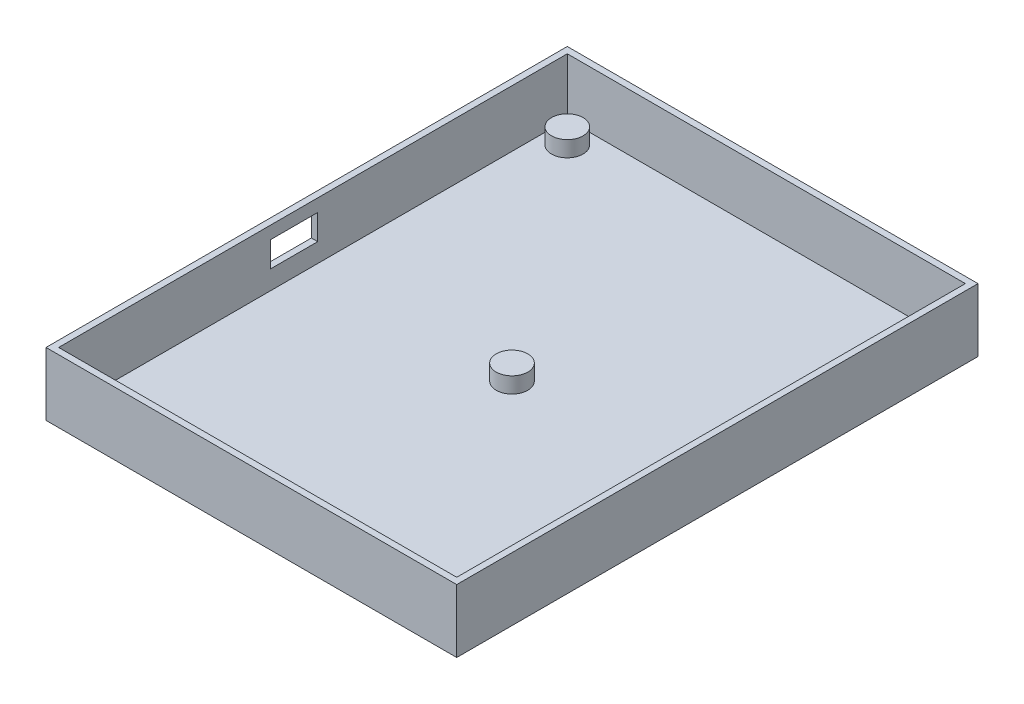
ISO-10303-21;
HEADER;
FILE_DESCRIPTION(('STEP AP214'),'2;1');
FILE_NAME('part.step','',(''),(''),'','','');
FILE_SCHEMA(('AUTOMOTIVE_DESIGN { 1 0 10303 214 1 1 1 1 }'));
ENDSEC;
DATA;
#1=APPLICATION_CONTEXT('core data for automotive mechanical design processes');
#2=APPLICATION_PROTOCOL_DEFINITION('international standard','automotive_design',2000,#1);
#3=PRODUCT_CONTEXT('',#1,'mechanical');
#4=PRODUCT('Part','Part','',(#3));
#5=PRODUCT_RELATED_PRODUCT_CATEGORY('part','',(#4));
#6=PRODUCT_DEFINITION_FORMATION('','',#4);
#7=PRODUCT_DEFINITION_CONTEXT('part definition',#1,'design');
#8=PRODUCT_DEFINITION('design','',#6,#7);
#9=PRODUCT_DEFINITION_SHAPE('','',#8);
#10=(LENGTH_UNIT() NAMED_UNIT(*) SI_UNIT(.MILLI.,.METRE.));
#11=(NAMED_UNIT(*) PLANE_ANGLE_UNIT() SI_UNIT($,.RADIAN.));
#12=(NAMED_UNIT(*) SI_UNIT($,.STERADIAN.) SOLID_ANGLE_UNIT());
#13=UNCERTAINTY_MEASURE_WITH_UNIT(LENGTH_MEASURE(1.E-05),#10,'distance_accuracy_value','');
#14=(GEOMETRIC_REPRESENTATION_CONTEXT(3) GLOBAL_UNCERTAINTY_ASSIGNED_CONTEXT((#13)) GLOBAL_UNIT_ASSIGNED_CONTEXT((#10,
#11,#12)) REPRESENTATION_CONTEXT('',''));
#15=CARTESIAN_POINT('',(0.,0.,0.));
#16=DIRECTION('',(0.,0.,1.));
#17=DIRECTION('',(1.,0.,0.));
#18=AXIS2_PLACEMENT_3D('',#15,#16,#17);
#19=CARTESIAN_POINT('',(32.5,10.,41.25));
#20=DIRECTION('',(-1.,0.,0.));
#21=DIRECTION('',(0.,0.,1.));
#22=AXIS2_PLACEMENT_3D('',#19,#20,#21);
#23=PLANE('',#22);
#24=DIRECTION('',(0.,0.,-1.));
#25=VECTOR('',#24,1.);
#26=CARTESIAN_POINT('',(32.5,0.,41.25));
#27=LINE('',#26,#25);
#28=CARTESIAN_POINT('',(32.5,0.,41.25));
#29=VERTEX_POINT('',#28);
#30=CARTESIAN_POINT('',(32.5,0.,-41.25));
#31=VERTEX_POINT('',#30);
#32=EDGE_CURVE('E212',#29,#31,#27,.T.);
#33=ORIENTED_EDGE('',*,*,#32,.T.);
#34=DIRECTION('',(0.,-1.,0.));
#35=VECTOR('',#34,1.);
#36=CARTESIAN_POINT('',(32.5,10.,-41.25));
#37=LINE('',#36,#35);
#38=CARTESIAN_POINT('',(32.5,10.,-41.25));
#39=VERTEX_POINT('',#38);
#40=EDGE_CURVE('E11',#39,#31,#37,.T.);
#41=ORIENTED_EDGE('',*,*,#40,.F.);
#42=DIRECTION('',(0.,0.,-1.));
#43=VECTOR('',#42,1.);
#44=CARTESIAN_POINT('',(32.5,10.,41.25));
#45=LINE('',#44,#43);
#46=CARTESIAN_POINT('',(32.5,10.,41.25));
#47=VERTEX_POINT('',#46);
#48=EDGE_CURVE('E219',#47,#39,#45,.T.);
#49=ORIENTED_EDGE('',*,*,#48,.F.);
#50=DIRECTION('',(0.,-1.,0.));
#51=VECTOR('',#50,1.);
#52=CARTESIAN_POINT('',(32.5,10.,41.25));
#53=LINE('',#52,#51);
#54=EDGE_CURVE('E229',#47,#29,#53,.T.);
#55=ORIENTED_EDGE('',*,*,#54,.T.);
#56=EDGE_LOOP('',(#33,#41,#49,#55));
#57=FACE_BOUND('',#56,.T.);
#58=ADVANCED_FACE('F32',(#57),#23,.F.);
#59=CARTESIAN_POINT('',(-32.5,10.,-41.25));
#60=DIRECTION('',(0.,0.,1.));
#61=DIRECTION('',(1.,0.,0.));
#62=AXIS2_PLACEMENT_3D('',#59,#60,#61);
#63=PLANE('',#62);
#64=DIRECTION('',(-1.,0.,0.));
#65=VECTOR('',#64,1.);
#66=CARTESIAN_POINT('',(-32.5,0.,-41.25));
#67=LINE('',#66,#65);
#68=CARTESIAN_POINT('',(-32.5,0.,-41.25));
#69=VERTEX_POINT('',#68);
#70=EDGE_CURVE('E232',#31,#69,#67,.T.);
#71=ORIENTED_EDGE('',*,*,#70,.T.);
#72=DIRECTION('',(0.,-1.,0.));
#73=VECTOR('',#72,1.);
#74=CARTESIAN_POINT('',(-32.5,10.,-41.25));
#75=LINE('',#74,#73);
#76=CARTESIAN_POINT('',(-32.5,10.,-41.25));
#77=VERTEX_POINT('',#76);
#78=EDGE_CURVE('E39',#77,#69,#75,.T.);
#79=ORIENTED_EDGE('',*,*,#78,.F.);
#80=DIRECTION('',(-1.,0.,0.));
#81=VECTOR('',#80,1.);
#82=CARTESIAN_POINT('',(-32.5,10.,-41.25));
#83=LINE('',#82,#81);
#84=EDGE_CURVE('E222',#39,#77,#83,.T.);
#85=ORIENTED_EDGE('',*,*,#84,.F.);
#86=ORIENTED_EDGE('',*,*,#40,.T.);
#87=EDGE_LOOP('',(#71,#79,#85,#86));
#88=FACE_BOUND('',#87,.T.);
#89=ADVANCED_FACE('F262',(#88),#63,.F.);
#90=CARTESIAN_POINT('',(-32.5,10.,41.25));
#91=DIRECTION('',(1.,0.,0.));
#92=DIRECTION('',(0.,0.,-1.));
#93=AXIS2_PLACEMENT_3D('',#90,#91,#92);
#94=PLANE('',#93);
#95=DIRECTION('',(0.,0.,1.));
#96=VECTOR('',#95,1.);
#97=CARTESIAN_POINT('',(-32.5,4.,-0.750000000000008));
#98=LINE('',#97,#96);
#99=CARTESIAN_POINT('',(-32.5,4.,-0.750000000000008));
#100=VERTEX_POINT('',#99);
#101=CARTESIAN_POINT('',(-32.5,4.,6.74999999999999));
#102=VERTEX_POINT('',#101);
#103=EDGE_CURVE('E147',#100,#102,#98,.T.);
#104=ORIENTED_EDGE('',*,*,#103,.F.);
#105=DIRECTION('',(0.,-1.,0.));
#106=VECTOR('',#105,1.);
#107=CARTESIAN_POINT('',(-32.5,8.,-0.750000000000008));
#108=LINE('',#107,#106);
#109=CARTESIAN_POINT('',(-32.5,8.,-0.750000000000008));
#110=VERTEX_POINT('',#109);
#111=EDGE_CURVE('E46',#110,#100,#108,.T.);
#112=ORIENTED_EDGE('',*,*,#111,.F.);
#113=DIRECTION('',(0.,0.,-1.));
#114=VECTOR('',#113,1.);
#115=CARTESIAN_POINT('',(-32.5,8.,-0.750000000000008));
#116=LINE('',#115,#114);
#117=CARTESIAN_POINT('',(-32.5,8.,6.74999999999999));
#118=VERTEX_POINT('',#117);
#119=EDGE_CURVE('E138',#118,#110,#116,.T.);
#120=ORIENTED_EDGE('',*,*,#119,.F.);
#121=DIRECTION('',(0.,1.,0.));
#122=VECTOR('',#121,1.);
#123=CARTESIAN_POINT('',(-32.5,8.,6.74999999999999));
#124=LINE('',#123,#122);
#125=EDGE_CURVE('E141',#102,#118,#124,.T.);
#126=ORIENTED_EDGE('',*,*,#125,.F.);
#127=EDGE_LOOP('',(#104,#112,#120,#126));
#128=FACE_BOUND('',#127,.T.);
#129=DIRECTION('',(0.,0.,1.));
#130=VECTOR('',#129,1.);
#131=CARTESIAN_POINT('',(-32.5,0.,41.25));
#132=LINE('',#131,#130);
#133=CARTESIAN_POINT('',(-32.5,0.,41.25));
#134=VERTEX_POINT('',#133);
#135=EDGE_CURVE('E234',#69,#134,#132,.T.);
#136=ORIENTED_EDGE('',*,*,#135,.T.);
#137=DIRECTION('',(0.,-1.,0.));
#138=VECTOR('',#137,1.);
#139=CARTESIAN_POINT('',(-32.5,10.,41.25));
#140=LINE('',#139,#138);
#141=CARTESIAN_POINT('',(-32.5,10.,41.25));
#142=VERTEX_POINT('',#141);
#143=EDGE_CURVE('E239',#142,#134,#140,.T.);
#144=ORIENTED_EDGE('',*,*,#143,.F.);
#145=DIRECTION('',(0.,0.,1.));
#146=VECTOR('',#145,1.);
#147=CARTESIAN_POINT('',(-32.5,10.,41.25));
#148=LINE('',#147,#146);
#149=EDGE_CURVE('E225',#77,#142,#148,.T.);
#150=ORIENTED_EDGE('',*,*,#149,.F.);
#151=ORIENTED_EDGE('',*,*,#78,.T.);
#152=EDGE_LOOP('',(#136,#144,#150,#151));
#153=FACE_BOUND('',#152,.T.);
#154=ADVANCED_FACE('F246',(#128,#153),#94,.F.);
#155=CARTESIAN_POINT('',(-32.5,10.,41.25));
#156=DIRECTION('',(0.,0.,-1.));
#157=DIRECTION('',(-1.,0.,0.));
#158=AXIS2_PLACEMENT_3D('',#155,#156,#157);
#159=PLANE('',#158);
#160=DIRECTION('',(1.,0.,0.));
#161=VECTOR('',#160,1.);
#162=CARTESIAN_POINT('',(-32.5,0.,41.25));
#163=LINE('',#162,#161);
#164=EDGE_CURVE('E223',#134,#29,#163,.T.);
#165=ORIENTED_EDGE('',*,*,#164,.T.);
#166=ORIENTED_EDGE('',*,*,#54,.F.);
#167=DIRECTION('',(1.,0.,0.));
#168=VECTOR('',#167,1.);
#169=CARTESIAN_POINT('',(-32.5,10.,41.25));
#170=LINE('',#169,#168);
#171=EDGE_CURVE('E227',#142,#47,#170,.T.);
#172=ORIENTED_EDGE('',*,*,#171,.F.);
#173=ORIENTED_EDGE('',*,*,#143,.T.);
#174=EDGE_LOOP('',(#165,#166,#172,#173));
#175=FACE_BOUND('',#174,.T.);
#176=ADVANCED_FACE('F255',(#175),#159,.F.);
#177=CARTESIAN_POINT('',(0.,10.,0.));
#178=DIRECTION('',(0.,-1.,0.));
#179=DIRECTION('',(0.,0.,-1.));
#180=AXIS2_PLACEMENT_3D('',#177,#178,#179);
#181=PLANE('',#180);
#182=DIRECTION('',(0.,0.,1.));
#183=VECTOR('',#182,1.);
#184=CARTESIAN_POINT('',(-31.5,10.,-40.25));
#185=LINE('',#184,#183);
#186=CARTESIAN_POINT('',(-31.5,10.,-40.25));
#187=VERTEX_POINT('',#186);
#188=CARTESIAN_POINT('',(-31.5,10.,40.25));
#189=VERTEX_POINT('',#188);
#190=EDGE_CURVE('E202',#187,#189,#185,.T.);
#191=ORIENTED_EDGE('',*,*,#190,.F.);
#192=DIRECTION('',(-1.,0.,0.));
#193=VECTOR('',#192,1.);
#194=CARTESIAN_POINT('',(31.5,10.,-40.25));
#195=LINE('',#194,#193);
#196=CARTESIAN_POINT('',(31.5,10.,-40.25));
#197=VERTEX_POINT('',#196);
#198=EDGE_CURVE('E184',#197,#187,#195,.T.);
#199=ORIENTED_EDGE('',*,*,#198,.F.);
#200=DIRECTION('',(0.,0.,-1.));
#201=VECTOR('',#200,1.);
#202=CARTESIAN_POINT('',(31.5,10.,40.25));
#203=LINE('',#202,#201);
#204=CARTESIAN_POINT('',(31.5,10.,40.25));
#205=VERTEX_POINT('',#204);
#206=EDGE_CURVE('E191',#205,#197,#203,.T.);
#207=ORIENTED_EDGE('',*,*,#206,.F.);
#208=DIRECTION('',(1.,0.,0.));
#209=VECTOR('',#208,1.);
#210=CARTESIAN_POINT('',(-31.5,10.,40.25));
#211=LINE('',#210,#209);
#212=EDGE_CURVE('E205',#189,#205,#211,.T.);
#213=ORIENTED_EDGE('',*,*,#212,.F.);
#214=EDGE_LOOP('',(#191,#199,#207,#213));
#215=FACE_BOUND('',#214,.T.);
#216=ORIENTED_EDGE('',*,*,#48,.T.);
#217=ORIENTED_EDGE('',*,*,#84,.T.);
#218=ORIENTED_EDGE('',*,*,#149,.T.);
#219=ORIENTED_EDGE('',*,*,#171,.T.);
#220=EDGE_LOOP('',(#216,#217,#218,#219));
#221=FACE_BOUND('',#220,.T.);
#222=ADVANCED_FACE('F261',(#215,#221),#181,.F.);
#223=CARTESIAN_POINT('',(0.,0.,0.));
#224=DIRECTION('',(0.,-1.,0.));
#225=DIRECTION('',(0.,0.,-1.));
#226=AXIS2_PLACEMENT_3D('',#223,#224,#225);
#227=PLANE('',#226);
#228=ORIENTED_EDGE('',*,*,#32,.F.);
#229=ORIENTED_EDGE('',*,*,#164,.F.);
#230=ORIENTED_EDGE('',*,*,#135,.F.);
#231=ORIENTED_EDGE('',*,*,#70,.F.);
#232=EDGE_LOOP('',(#228,#229,#230,#231));
#233=FACE_BOUND('',#232,.T.);
#234=ADVANCED_FACE('F252',(#233),#227,.T.);
#235=CARTESIAN_POINT('',(31.5,1.,-40.25));
#236=DIRECTION('',(0.,0.,-1.));
#237=DIRECTION('',(-1.,0.,0.));
#238=AXIS2_PLACEMENT_3D('',#235,#236,#237);
#239=PLANE('',#238);
#240=ORIENTED_EDGE('',*,*,#198,.T.);
#241=DIRECTION('',(0.,1.,0.));
#242=VECTOR('',#241,1.);
#243=CARTESIAN_POINT('',(-31.5,1.,-40.25));
#244=LINE('',#243,#242);
#245=CARTESIAN_POINT('',(-31.5,1.,-40.25));
#246=VERTEX_POINT('',#245);
#247=EDGE_CURVE('E200',#246,#187,#244,.T.);
#248=ORIENTED_EDGE('',*,*,#247,.F.);
#249=DIRECTION('',(-1.,0.,0.));
#250=VECTOR('',#249,1.);
#251=CARTESIAN_POINT('',(31.5,1.,-40.25));
#252=LINE('',#251,#250);
#253=CARTESIAN_POINT('',(31.5,1.,-40.25));
#254=VERTEX_POINT('',#253);
#255=EDGE_CURVE('E187',#254,#246,#252,.T.);
#256=ORIENTED_EDGE('',*,*,#255,.F.);
#257=DIRECTION('',(0.,1.,0.));
#258=VECTOR('',#257,1.);
#259=CARTESIAN_POINT('',(31.5,1.,-40.25));
#260=LINE('',#259,#258);
#261=EDGE_CURVE('E210',#254,#197,#260,.T.);
#262=ORIENTED_EDGE('',*,*,#261,.T.);
#263=EDGE_LOOP('',(#240,#248,#256,#262));
#264=FACE_BOUND('',#263,.T.);
#265=ADVANCED_FACE('F275',(#264),#239,.F.);
#266=CARTESIAN_POINT('',(31.5,1.,40.25));
#267=DIRECTION('',(1.,0.,0.));
#268=DIRECTION('',(0.,0.,-1.));
#269=AXIS2_PLACEMENT_3D('',#266,#267,#268);
#270=PLANE('',#269);
#271=ORIENTED_EDGE('',*,*,#206,.T.);
#272=ORIENTED_EDGE('',*,*,#261,.F.);
#273=DIRECTION('',(0.,0.,-1.));
#274=VECTOR('',#273,1.);
#275=CARTESIAN_POINT('',(31.5,1.,40.25));
#276=LINE('',#275,#274);
#277=CARTESIAN_POINT('',(31.5,1.,40.25));
#278=VERTEX_POINT('',#277);
#279=EDGE_CURVE('E197',#278,#254,#276,.T.);
#280=ORIENTED_EDGE('',*,*,#279,.F.);
#281=DIRECTION('',(0.,1.,0.));
#282=VECTOR('',#281,1.);
#283=CARTESIAN_POINT('',(31.5,1.,40.25));
#284=LINE('',#283,#282);
#285=EDGE_CURVE('E213',#278,#205,#284,.T.);
#286=ORIENTED_EDGE('',*,*,#285,.T.);
#287=EDGE_LOOP('',(#271,#272,#280,#286));
#288=FACE_BOUND('',#287,.T.);
#289=ADVANCED_FACE('F281',(#288),#270,.F.);
#290=CARTESIAN_POINT('',(-31.5,1.,40.25));
#291=DIRECTION('',(0.,0.,1.));
#292=DIRECTION('',(1.,0.,0.));
#293=AXIS2_PLACEMENT_3D('',#290,#291,#292);
#294=PLANE('',#293);
#295=ORIENTED_EDGE('',*,*,#212,.T.);
#296=ORIENTED_EDGE('',*,*,#285,.F.);
#297=DIRECTION('',(1.,0.,0.));
#298=VECTOR('',#297,1.);
#299=CARTESIAN_POINT('',(-31.5,1.,40.25));
#300=LINE('',#299,#298);
#301=CARTESIAN_POINT('',(-31.5,1.,40.25));
#302=VERTEX_POINT('',#301);
#303=EDGE_CURVE('E194',#302,#278,#300,.T.);
#304=ORIENTED_EDGE('',*,*,#303,.F.);
#305=DIRECTION('',(0.,1.,0.));
#306=VECTOR('',#305,1.);
#307=CARTESIAN_POINT('',(-31.5,1.,40.25));
#308=LINE('',#307,#306);
#309=EDGE_CURVE('E215',#302,#189,#308,.T.);
#310=ORIENTED_EDGE('',*,*,#309,.T.);
#311=EDGE_LOOP('',(#295,#296,#304,#310));
#312=FACE_BOUND('',#311,.T.);
#313=ADVANCED_FACE('F286',(#312),#294,.F.);
#314=CARTESIAN_POINT('',(-31.5,1.,-40.25));
#315=DIRECTION('',(-1.,0.,0.));
#316=DIRECTION('',(0.,0.,1.));
#317=AXIS2_PLACEMENT_3D('',#314,#315,#316);
#318=PLANE('',#317);
#319=DIRECTION('',(0.,0.,-1.));
#320=VECTOR('',#319,1.);
#321=CARTESIAN_POINT('',(-31.5,8.,-0.750000000000008));
#322=LINE('',#321,#320);
#323=CARTESIAN_POINT('',(-31.5,8.,6.74999999999999));
#324=VERTEX_POINT('',#323);
#325=CARTESIAN_POINT('',(-31.5,8.,-0.750000000000008));
#326=VERTEX_POINT('',#325);
#327=EDGE_CURVE('E128',#324,#326,#322,.T.);
#328=ORIENTED_EDGE('',*,*,#327,.T.);
#329=DIRECTION('',(0.,-1.,0.));
#330=VECTOR('',#329,1.);
#331=CARTESIAN_POINT('',(-31.5,8.,-0.750000000000008));
#332=LINE('',#331,#330);
#333=CARTESIAN_POINT('',(-31.5,4.,-0.750000000000008));
#334=VERTEX_POINT('',#333);
#335=EDGE_CURVE('E122',#326,#334,#332,.T.);
#336=ORIENTED_EDGE('',*,*,#335,.T.);
#337=DIRECTION('',(0.,0.,1.));
#338=VECTOR('',#337,1.);
#339=CARTESIAN_POINT('',(-31.5,4.,-0.750000000000008));
#340=LINE('',#339,#338);
#341=CARTESIAN_POINT('',(-31.5,4.,6.74999999999999));
#342=VERTEX_POINT('',#341);
#343=EDGE_CURVE('E131',#334,#342,#340,.T.);
#344=ORIENTED_EDGE('',*,*,#343,.T.);
#345=DIRECTION('',(0.,1.,0.));
#346=VECTOR('',#345,1.);
#347=CARTESIAN_POINT('',(-31.5,8.,6.74999999999999));
#348=LINE('',#347,#346);
#349=EDGE_CURVE('E54',#342,#324,#348,.T.);
#350=ORIENTED_EDGE('',*,*,#349,.T.);
#351=EDGE_LOOP('',(#328,#336,#344,#350));
#352=FACE_BOUND('',#351,.T.);
#353=ORIENTED_EDGE('',*,*,#190,.T.);
#354=ORIENTED_EDGE('',*,*,#309,.F.);
#355=DIRECTION('',(0.,0.,1.));
#356=VECTOR('',#355,1.);
#357=CARTESIAN_POINT('',(-31.5,1.,-40.25));
#358=LINE('',#357,#356);
#359=EDGE_CURVE('E190',#246,#302,#358,.T.);
#360=ORIENTED_EDGE('',*,*,#359,.F.);
#361=ORIENTED_EDGE('',*,*,#247,.T.);
#362=EDGE_LOOP('',(#353,#354,#360,#361));
#363=FACE_BOUND('',#362,.T.);
#364=ADVANCED_FACE('F135',(#352,#363),#318,.F.);
#365=CARTESIAN_POINT('',(0.,1.,0.));
#366=DIRECTION('',(0.,1.,0.));
#367=DIRECTION('',(0.,0.,1.));
#368=AXIS2_PLACEMENT_3D('',#365,#366,#367);
#369=PLANE('',#368);
#370=CARTESIAN_POINT('',(0.,1.,0.));
#371=DIRECTION('',(0.,1.,0.));
#372=DIRECTION('',(0.,0.,1.));
#373=AXIS2_PLACEMENT_3D('',#370,#371,#372);
#374=CIRCLE('',#373,2.5);
#375=CARTESIAN_POINT('',(0.,1.,2.5));
#376=VERTEX_POINT('',#375);
#377=EDGE_CURVE('E153',#376,#376,#374,.T.);
#378=ORIENTED_EDGE('',*,*,#377,.F.);
#379=EDGE_LOOP('',(#378));
#380=FACE_BOUND('',#379,.T.);
#381=CARTESIAN_POINT('',(28.,1.,36.75));
#382=DIRECTION('',(0.,1.,0.));
#383=DIRECTION('',(0.,0.,1.));
#384=AXIS2_PLACEMENT_3D('',#381,#382,#383);
#385=CIRCLE('',#384,2.5);
#386=CARTESIAN_POINT('',(28.,1.,39.25));
#387=VERTEX_POINT('',#386);
#388=EDGE_CURVE('E160',#387,#387,#385,.T.);
#389=ORIENTED_EDGE('',*,*,#388,.F.);
#390=EDGE_LOOP('',(#389));
#391=FACE_BOUND('',#390,.T.);
#392=CARTESIAN_POINT('',(-28.,1.,36.75));
#393=DIRECTION('',(0.,1.,0.));
#394=DIRECTION('',(0.,0.,1.));
#395=AXIS2_PLACEMENT_3D('',#392,#393,#394);
#396=CIRCLE('',#395,2.5);
#397=CARTESIAN_POINT('',(-28.,1.,39.25));
#398=VERTEX_POINT('',#397);
#399=EDGE_CURVE('E166',#398,#398,#396,.T.);
#400=ORIENTED_EDGE('',*,*,#399,.F.);
#401=EDGE_LOOP('',(#400));
#402=FACE_BOUND('',#401,.T.);
#403=CARTESIAN_POINT('',(28.,1.,-36.75));
#404=DIRECTION('',(0.,1.,0.));
#405=DIRECTION('',(0.,0.,1.));
#406=AXIS2_PLACEMENT_3D('',#403,#404,#405);
#407=CIRCLE('',#406,2.5);
#408=CARTESIAN_POINT('',(28.,1.,-34.25));
#409=VERTEX_POINT('',#408);
#410=EDGE_CURVE('E172',#409,#409,#407,.T.);
#411=ORIENTED_EDGE('',*,*,#410,.F.);
#412=EDGE_LOOP('',(#411));
#413=FACE_BOUND('',#412,.T.);
#414=CARTESIAN_POINT('',(-28.,1.,-36.75));
#415=DIRECTION('',(0.,1.,0.));
#416=DIRECTION('',(0.,0.,1.));
#417=AXIS2_PLACEMENT_3D('',#414,#415,#416);
#418=CIRCLE('',#417,2.5);
#419=CARTESIAN_POINT('',(-28.,1.,-34.25));
#420=VERTEX_POINT('',#419);
#421=EDGE_CURVE('E178',#420,#420,#418,.T.);
#422=ORIENTED_EDGE('',*,*,#421,.F.);
#423=EDGE_LOOP('',(#422));
#424=FACE_BOUND('',#423,.T.);
#425=ORIENTED_EDGE('',*,*,#255,.T.);
#426=ORIENTED_EDGE('',*,*,#359,.T.);
#427=ORIENTED_EDGE('',*,*,#303,.T.);
#428=ORIENTED_EDGE('',*,*,#279,.T.);
#429=EDGE_LOOP('',(#425,#426,#427,#428));
#430=FACE_BOUND('',#429,.T.);
#431=ADVANCED_FACE('F285',(#380,#391,#402,#413,#424,#430),#369,.T.);
#432=CARTESIAN_POINT('',(-28.,3.5,-36.75));
#433=DIRECTION('',(0.,-1.,0.));
#434=DIRECTION('',(0.,0.,-1.));
#435=AXIS2_PLACEMENT_3D('',#432,#433,#434);
#436=CYLINDRICAL_SURFACE('',#435,2.5);
#437=CARTESIAN_POINT('',(-28.,3.5,-36.75));
#438=DIRECTION('',(0.,1.,0.));
#439=DIRECTION('',(0.,0.,1.));
#440=AXIS2_PLACEMENT_3D('',#437,#438,#439);
#441=CIRCLE('',#440,2.5);
#442=CARTESIAN_POINT('',(-28.,3.5,-34.25));
#443=VERTEX_POINT('',#442);
#444=EDGE_CURVE('E181',#443,#443,#441,.T.);
#445=ORIENTED_EDGE('',*,*,#444,.F.);
#446=EDGE_LOOP('',(#445));
#447=FACE_BOUND('',#446,.T.);
#448=ORIENTED_EDGE('',*,*,#421,.T.);
#449=EDGE_LOOP('',(#448));
#450=FACE_BOUND('',#449,.T.);
#451=ADVANCED_FACE('F295',(#447,#450),#436,.T.);
#452=CARTESIAN_POINT('',(-28.,3.5,-36.75));
#453=DIRECTION('',(0.,1.,0.));
#454=DIRECTION('',(0.,0.,1.));
#455=AXIS2_PLACEMENT_3D('',#452,#453,#454);
#456=PLANE('',#455);
#457=ORIENTED_EDGE('',*,*,#444,.T.);
#458=EDGE_LOOP('',(#457));
#459=FACE_BOUND('',#458,.T.);
#460=ADVANCED_FACE('F299',(#459),#456,.T.);
#461=CARTESIAN_POINT('',(28.,3.5,-36.75));
#462=DIRECTION('',(0.,-1.,0.));
#463=DIRECTION('',(0.,0.,-1.));
#464=AXIS2_PLACEMENT_3D('',#461,#462,#463);
#465=CYLINDRICAL_SURFACE('',#464,2.5);
#466=CARTESIAN_POINT('',(28.,3.5,-36.75));
#467=DIRECTION('',(0.,1.,0.));
#468=DIRECTION('',(0.,0.,1.));
#469=AXIS2_PLACEMENT_3D('',#466,#467,#468);
#470=CIRCLE('',#469,2.5);
#471=CARTESIAN_POINT('',(28.,3.5,-34.25));
#472=VERTEX_POINT('',#471);
#473=EDGE_CURVE('E175',#472,#472,#470,.T.);
#474=ORIENTED_EDGE('',*,*,#473,.F.);
#475=EDGE_LOOP('',(#474));
#476=FACE_BOUND('',#475,.T.);
#477=ORIENTED_EDGE('',*,*,#410,.T.);
#478=EDGE_LOOP('',(#477));
#479=FACE_BOUND('',#478,.T.);
#480=ADVANCED_FACE('F303',(#476,#479),#465,.T.);
#481=CARTESIAN_POINT('',(28.,3.5,-36.75));
#482=DIRECTION('',(0.,1.,0.));
#483=DIRECTION('',(0.,0.,1.));
#484=AXIS2_PLACEMENT_3D('',#481,#482,#483);
#485=PLANE('',#484);
#486=ORIENTED_EDGE('',*,*,#473,.T.);
#487=EDGE_LOOP('',(#486));
#488=FACE_BOUND('',#487,.T.);
#489=ADVANCED_FACE('F307',(#488),#485,.T.);
#490=CARTESIAN_POINT('',(-28.,3.5,36.75));
#491=DIRECTION('',(0.,-1.,0.));
#492=DIRECTION('',(0.,0.,-1.));
#493=AXIS2_PLACEMENT_3D('',#490,#491,#492);
#494=CYLINDRICAL_SURFACE('',#493,2.5);
#495=CARTESIAN_POINT('',(-28.,3.5,36.75));
#496=DIRECTION('',(0.,1.,0.));
#497=DIRECTION('',(0.,0.,1.));
#498=AXIS2_PLACEMENT_3D('',#495,#496,#497);
#499=CIRCLE('',#498,2.5);
#500=CARTESIAN_POINT('',(-28.,3.5,39.25));
#501=VERTEX_POINT('',#500);
#502=EDGE_CURVE('E169',#501,#501,#499,.T.);
#503=ORIENTED_EDGE('',*,*,#502,.F.);
#504=EDGE_LOOP('',(#503));
#505=FACE_BOUND('',#504,.T.);
#506=ORIENTED_EDGE('',*,*,#399,.T.);
#507=EDGE_LOOP('',(#506));
#508=FACE_BOUND('',#507,.T.);
#509=ADVANCED_FACE('F311',(#505,#508),#494,.T.);
#510=CARTESIAN_POINT('',(-28.,3.5,36.75));
#511=DIRECTION('',(0.,1.,0.));
#512=DIRECTION('',(0.,0.,1.));
#513=AXIS2_PLACEMENT_3D('',#510,#511,#512);
#514=PLANE('',#513);
#515=ORIENTED_EDGE('',*,*,#502,.T.);
#516=EDGE_LOOP('',(#515));
#517=FACE_BOUND('',#516,.T.);
#518=ADVANCED_FACE('F315',(#517),#514,.T.);
#519=CARTESIAN_POINT('',(28.,3.5,36.75));
#520=DIRECTION('',(0.,-1.,0.));
#521=DIRECTION('',(0.,0.,-1.));
#522=AXIS2_PLACEMENT_3D('',#519,#520,#521);
#523=CYLINDRICAL_SURFACE('',#522,2.5);
#524=CARTESIAN_POINT('',(28.,3.5,36.75));
#525=DIRECTION('',(0.,1.,0.));
#526=DIRECTION('',(0.,0.,1.));
#527=AXIS2_PLACEMENT_3D('',#524,#525,#526);
#528=CIRCLE('',#527,2.5);
#529=CARTESIAN_POINT('',(28.,3.5,39.25));
#530=VERTEX_POINT('',#529);
#531=EDGE_CURVE('E163',#530,#530,#528,.T.);
#532=ORIENTED_EDGE('',*,*,#531,.F.);
#533=EDGE_LOOP('',(#532));
#534=FACE_BOUND('',#533,.T.);
#535=ORIENTED_EDGE('',*,*,#388,.T.);
#536=EDGE_LOOP('',(#535));
#537=FACE_BOUND('',#536,.T.);
#538=ADVANCED_FACE('F319',(#534,#537),#523,.T.);
#539=CARTESIAN_POINT('',(28.,3.5,36.75));
#540=DIRECTION('',(0.,1.,0.));
#541=DIRECTION('',(0.,0.,1.));
#542=AXIS2_PLACEMENT_3D('',#539,#540,#541);
#543=PLANE('',#542);
#544=ORIENTED_EDGE('',*,*,#531,.T.);
#545=EDGE_LOOP('',(#544));
#546=FACE_BOUND('',#545,.T.);
#547=ADVANCED_FACE('F323',(#546),#543,.T.);
#548=CARTESIAN_POINT('',(0.,3.5,0.));
#549=DIRECTION('',(0.,-1.,0.));
#550=DIRECTION('',(0.,0.,-1.));
#551=AXIS2_PLACEMENT_3D('',#548,#549,#550);
#552=CYLINDRICAL_SURFACE('',#551,2.5);
#553=CARTESIAN_POINT('',(0.,3.5,0.));
#554=DIRECTION('',(0.,1.,0.));
#555=DIRECTION('',(0.,0.,1.));
#556=AXIS2_PLACEMENT_3D('',#553,#554,#555);
#557=CIRCLE('',#556,2.5);
#558=CARTESIAN_POINT('',(0.,3.5,2.5));
#559=VERTEX_POINT('',#558);
#560=EDGE_CURVE('E157',#559,#559,#557,.T.);
#561=ORIENTED_EDGE('',*,*,#560,.F.);
#562=EDGE_LOOP('',(#561));
#563=FACE_BOUND('',#562,.T.);
#564=ORIENTED_EDGE('',*,*,#377,.T.);
#565=EDGE_LOOP('',(#564));
#566=FACE_BOUND('',#565,.T.);
#567=ADVANCED_FACE('F327',(#563,#566),#552,.T.);
#568=CARTESIAN_POINT('',(0.,3.5,0.));
#569=DIRECTION('',(0.,1.,0.));
#570=DIRECTION('',(0.,0.,1.));
#571=AXIS2_PLACEMENT_3D('',#568,#569,#570);
#572=PLANE('',#571);
#573=ORIENTED_EDGE('',*,*,#560,.T.);
#574=EDGE_LOOP('',(#573));
#575=FACE_BOUND('',#574,.T.);
#576=ADVANCED_FACE('F331',(#575),#572,.T.);
#577=CARTESIAN_POINT('',(-31.5,8.,-0.750000000000008));
#578=DIRECTION('',(0.,0.,-1.));
#579=DIRECTION('',(0.,1.,0.));
#580=AXIS2_PLACEMENT_3D('',#577,#578,#579);
#581=PLANE('',#580);
#582=ORIENTED_EDGE('',*,*,#111,.T.);
#583=DIRECTION('',(-1.,0.,0.));
#584=VECTOR('',#583,1.);
#585=CARTESIAN_POINT('',(-31.5,4.,-0.750000000000008));
#586=LINE('',#585,#584);
#587=EDGE_CURVE('E118',#334,#100,#586,.T.);
#588=ORIENTED_EDGE('',*,*,#587,.F.);
#589=ORIENTED_EDGE('',*,*,#335,.F.);
#590=DIRECTION('',(-1.,0.,0.));
#591=VECTOR('',#590,1.);
#592=CARTESIAN_POINT('',(-31.5,8.,-0.750000000000008));
#593=LINE('',#592,#591);
#594=EDGE_CURVE('E151',#326,#110,#593,.T.);
#595=ORIENTED_EDGE('',*,*,#594,.T.);
#596=EDGE_LOOP('',(#582,#588,#589,#595));
#597=FACE_BOUND('',#596,.T.);
#598=ADVANCED_FACE('F120',(#597),#581,.F.);
#599=CARTESIAN_POINT('',(-31.5,8.,-0.750000000000008));
#600=DIRECTION('',(0.,1.,0.));
#601=DIRECTION('',(0.,0.,1.));
#602=AXIS2_PLACEMENT_3D('',#599,#600,#601);
#603=PLANE('',#602);
#604=ORIENTED_EDGE('',*,*,#119,.T.);
#605=ORIENTED_EDGE('',*,*,#594,.F.);
#606=ORIENTED_EDGE('',*,*,#327,.F.);
#607=DIRECTION('',(-1.,0.,0.));
#608=VECTOR('',#607,1.);
#609=CARTESIAN_POINT('',(-31.5,8.,6.74999999999999));
#610=LINE('',#609,#608);
#611=EDGE_CURVE('E154',#324,#118,#610,.T.);
#612=ORIENTED_EDGE('',*,*,#611,.T.);
#613=EDGE_LOOP('',(#604,#605,#606,#612));
#614=FACE_BOUND('',#613,.T.);
#615=ADVANCED_FACE('F338',(#614),#603,.F.);
#616=CARTESIAN_POINT('',(-31.5,8.,6.74999999999999));
#617=DIRECTION('',(0.,0.,1.));
#618=DIRECTION('',(0.,-1.,0.));
#619=AXIS2_PLACEMENT_3D('',#616,#617,#618);
#620=PLANE('',#619);
#621=ORIENTED_EDGE('',*,*,#125,.T.);
#622=ORIENTED_EDGE('',*,*,#611,.F.);
#623=ORIENTED_EDGE('',*,*,#349,.F.);
#624=DIRECTION('',(-1.,0.,0.));
#625=VECTOR('',#624,1.);
#626=CARTESIAN_POINT('',(-31.5,4.,6.74999999999999));
#627=LINE('',#626,#625);
#628=EDGE_CURVE('E127',#342,#102,#627,.T.);
#629=ORIENTED_EDGE('',*,*,#628,.T.);
#630=EDGE_LOOP('',(#621,#622,#623,#629));
#631=FACE_BOUND('',#630,.T.);
#632=ADVANCED_FACE('F341',(#631),#620,.F.);
#633=CARTESIAN_POINT('',(-31.5,4.,-0.750000000000008));
#634=DIRECTION('',(0.,-1.,0.));
#635=DIRECTION('',(0.,0.,-1.));
#636=AXIS2_PLACEMENT_3D('',#633,#634,#635);
#637=PLANE('',#636);
#638=ORIENTED_EDGE('',*,*,#103,.T.);
#639=ORIENTED_EDGE('',*,*,#628,.F.);
#640=ORIENTED_EDGE('',*,*,#343,.F.);
#641=ORIENTED_EDGE('',*,*,#587,.T.);
#642=EDGE_LOOP('',(#638,#639,#640,#641));
#643=FACE_BOUND('',#642,.T.);
#644=ADVANCED_FACE('F132',(#643),#637,.F.);
#645=CLOSED_SHELL('',(#58,#89,#154,#176,#222,#234,#265,#289,#313,#364,#431,#451,#460,#480,#489,
#509,#518,#538,#547,#567,#576,#598,#615,#632,#644));
#646=MANIFOLD_SOLID_BREP('B2',#645);
#647=ADVANCED_BREP_SHAPE_REPRESENTATION('',(#18,#646),#14);
#648=SHAPE_DEFINITION_REPRESENTATION(#9,#647);
ENDSEC;
END-ISO-10303-21;
